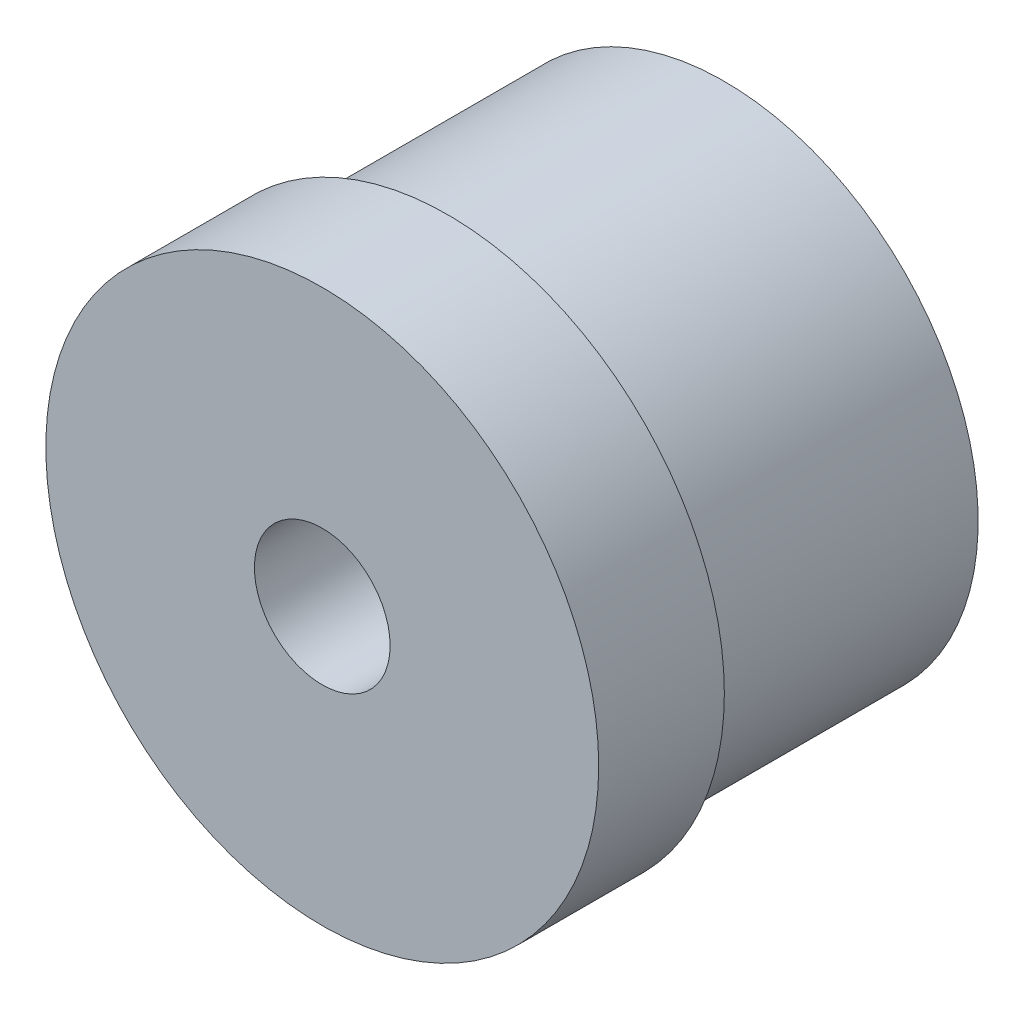
ISO-10303-21;
HEADER;
FILE_DESCRIPTION(('STEP AP214'),'2;1');
FILE_NAME('part.step','',(''),(''),'','','');
FILE_SCHEMA(('AUTOMOTIVE_DESIGN { 1 0 10303 214 1 1 1 1 }'));
ENDSEC;
DATA;
#1=APPLICATION_CONTEXT('core data for automotive mechanical design processes');
#2=APPLICATION_PROTOCOL_DEFINITION('international standard','automotive_design',2000,#1);
#3=PRODUCT_CONTEXT('',#1,'mechanical');
#4=PRODUCT('Part','Part','',(#3));
#5=PRODUCT_RELATED_PRODUCT_CATEGORY('part','',(#4));
#6=PRODUCT_DEFINITION_FORMATION('','',#4);
#7=PRODUCT_DEFINITION_CONTEXT('part definition',#1,'design');
#8=PRODUCT_DEFINITION('design','',#6,#7);
#9=PRODUCT_DEFINITION_SHAPE('','',#8);
#10=(LENGTH_UNIT() NAMED_UNIT(*) SI_UNIT(.MILLI.,.METRE.));
#11=(NAMED_UNIT(*) PLANE_ANGLE_UNIT() SI_UNIT($,.RADIAN.));
#12=(NAMED_UNIT(*) SI_UNIT($,.STERADIAN.) SOLID_ANGLE_UNIT());
#13=UNCERTAINTY_MEASURE_WITH_UNIT(LENGTH_MEASURE(1.E-05),#10,'distance_accuracy_value','');
#14=(GEOMETRIC_REPRESENTATION_CONTEXT(3) GLOBAL_UNCERTAINTY_ASSIGNED_CONTEXT((#13)) GLOBAL_UNIT_ASSIGNED_CONTEXT((#10,
#11,#12)) REPRESENTATION_CONTEXT('',''));
#15=CARTESIAN_POINT('',(0.,0.,0.));
#16=DIRECTION('',(0.,0.,1.));
#17=DIRECTION('',(1.,0.,0.));
#18=AXIS2_PLACEMENT_3D('',#15,#16,#17);
#19=CARTESIAN_POINT('',(0.,0.,5.));
#20=DIRECTION('',(0.,0.,-1.));
#21=DIRECTION('',(-1.,0.,0.));
#22=AXIS2_PLACEMENT_3D('',#19,#20,#21);
#23=CYLINDRICAL_SURFACE('',#22,11.);
#24=CARTESIAN_POINT('',(0.,0.,5.));
#25=DIRECTION('',(0.,0.,1.));
#26=DIRECTION('',(1.,0.,0.));
#27=AXIS2_PLACEMENT_3D('',#24,#25,#26);
#28=CIRCLE('',#27,11.);
#29=CARTESIAN_POINT('',(11.,0.,5.));
#30=VERTEX_POINT('',#29);
#31=EDGE_CURVE('E51',#30,#30,#28,.T.);
#32=ORIENTED_EDGE('',*,*,#31,.F.);
#33=EDGE_LOOP('',(#32));
#34=FACE_BOUND('',#33,.T.);
#35=CARTESIAN_POINT('',(0.,0.,0.));
#36=DIRECTION('',(0.,0.,1.));
#37=DIRECTION('',(1.,0.,0.));
#38=AXIS2_PLACEMENT_3D('',#35,#36,#37);
#39=CIRCLE('',#38,11.);
#40=CARTESIAN_POINT('',(11.,0.,0.));
#41=VERTEX_POINT('',#40);
#42=EDGE_CURVE('E46',#41,#41,#39,.T.);
#43=ORIENTED_EDGE('',*,*,#42,.T.);
#44=EDGE_LOOP('',(#43));
#45=FACE_BOUND('',#44,.T.);
#46=ADVANCED_FACE('F43',(#34,#45),#23,.T.);
#47=CARTESIAN_POINT('',(0.,0.,5.));
#48=DIRECTION('',(0.,0.,1.));
#49=DIRECTION('',(1.,0.,0.));
#50=AXIS2_PLACEMENT_3D('',#47,#48,#49);
#51=PLANE('',#50);
#52=CARTESIAN_POINT('',(0.,0.,5.));
#53=DIRECTION('',(0.,0.,1.));
#54=DIRECTION('',(1.,0.,0.));
#55=AXIS2_PLACEMENT_3D('',#52,#53,#54);
#56=CIRCLE('',#55,2.7);
#57=CARTESIAN_POINT('',(2.7,0.,5.));
#58=VERTEX_POINT('',#57);
#59=EDGE_CURVE('E63',#58,#58,#56,.T.);
#60=ORIENTED_EDGE('',*,*,#59,.F.);
#61=EDGE_LOOP('',(#60));
#62=FACE_BOUND('',#61,.T.);
#63=ORIENTED_EDGE('',*,*,#31,.T.);
#64=EDGE_LOOP('',(#63));
#65=FACE_BOUND('',#64,.T.);
#66=ADVANCED_FACE('F80',(#62,#65),#51,.T.);
#67=CARTESIAN_POINT('',(0.,0.,0.));
#68=DIRECTION('',(0.,0.,1.));
#69=DIRECTION('',(1.,0.,0.));
#70=AXIS2_PLACEMENT_3D('',#67,#68,#69);
#71=PLANE('',#70);
#72=CARTESIAN_POINT('',(0.,0.,0.));
#73=DIRECTION('',(0.,0.,-1.));
#74=DIRECTION('',(-1.,0.,0.));
#75=AXIS2_PLACEMENT_3D('',#72,#73,#74);
#76=CIRCLE('',#75,10.1);
#77=CARTESIAN_POINT('',(-10.1,0.,0.));
#78=VERTEX_POINT('',#77);
#79=EDGE_CURVE('E10',#78,#78,#76,.T.);
#80=ORIENTED_EDGE('',*,*,#79,.F.);
#81=EDGE_LOOP('',(#80));
#82=FACE_BOUND('',#81,.T.);
#83=ORIENTED_EDGE('',*,*,#42,.F.);
#84=EDGE_LOOP('',(#83));
#85=FACE_BOUND('',#84,.T.);
#86=ADVANCED_FACE('F83',(#82,#85),#71,.F.);
#87=CARTESIAN_POINT('',(0.,0.,-11.));
#88=DIRECTION('',(0.,0.,1.));
#89=DIRECTION('',(1.,0.,0.));
#90=AXIS2_PLACEMENT_3D('',#87,#88,#89);
#91=CYLINDRICAL_SURFACE('',#90,10.1);
#92=CARTESIAN_POINT('',(0.,0.,-11.));
#93=DIRECTION('',(0.,0.,-1.));
#94=DIRECTION('',(-1.,0.,0.));
#95=AXIS2_PLACEMENT_3D('',#92,#93,#94);
#96=CIRCLE('',#95,10.1);
#97=CARTESIAN_POINT('',(-10.1,0.,-11.));
#98=VERTEX_POINT('',#97);
#99=EDGE_CURVE('E58',#98,#98,#96,.T.);
#100=ORIENTED_EDGE('',*,*,#99,.F.);
#101=EDGE_LOOP('',(#100));
#102=FACE_BOUND('',#101,.T.);
#103=ORIENTED_EDGE('',*,*,#79,.T.);
#104=EDGE_LOOP('',(#103));
#105=FACE_BOUND('',#104,.T.);
#106=ADVANCED_FACE('F94',(#102,#105),#91,.T.);
#107=CARTESIAN_POINT('',(0.,0.,-11.));
#108=DIRECTION('',(0.,0.,-1.));
#109=DIRECTION('',(-1.,0.,0.));
#110=AXIS2_PLACEMENT_3D('',#107,#108,#109);
#111=PLANE('',#110);
#112=CARTESIAN_POINT('',(0.,0.,-11.));
#113=DIRECTION('',(0.,0.,1.));
#114=DIRECTION('',(1.,0.,0.));
#115=AXIS2_PLACEMENT_3D('',#112,#113,#114);
#116=CIRCLE('',#115,2.7);
#117=CARTESIAN_POINT('',(2.7,0.,-11.));
#118=VERTEX_POINT('',#117);
#119=EDGE_CURVE('E62',#118,#118,#116,.T.);
#120=ORIENTED_EDGE('',*,*,#119,.T.);
#121=EDGE_LOOP('',(#120));
#122=FACE_BOUND('',#121,.T.);
#123=ORIENTED_EDGE('',*,*,#99,.T.);
#124=EDGE_LOOP('',(#123));
#125=FACE_BOUND('',#124,.T.);
#126=ADVANCED_FACE('F71',(#122,#125),#111,.T.);
#127=CARTESIAN_POINT('',(0.,0.,-11.));
#128=DIRECTION('',(0.,0.,1.));
#129=DIRECTION('',(1.,0.,0.));
#130=AXIS2_PLACEMENT_3D('',#127,#128,#129);
#131=CYLINDRICAL_SURFACE('',#130,2.7);
#132=ORIENTED_EDGE('',*,*,#119,.F.);
#133=EDGE_LOOP('',(#132));
#134=FACE_BOUND('',#133,.T.);
#135=ORIENTED_EDGE('',*,*,#59,.T.);
#136=EDGE_LOOP('',(#135));
#137=FACE_BOUND('',#136,.T.);
#138=ADVANCED_FACE('F74',(#134,#137),#131,.F.);
#139=CLOSED_SHELL('',(#46,#66,#86,#106,#126,#138));
#140=MANIFOLD_SOLID_BREP('B2',#139);
#141=ADVANCED_BREP_SHAPE_REPRESENTATION('',(#18,#140),#14);
#142=SHAPE_DEFINITION_REPRESENTATION(#9,#141);
ENDSEC;
END-ISO-10303-21;
